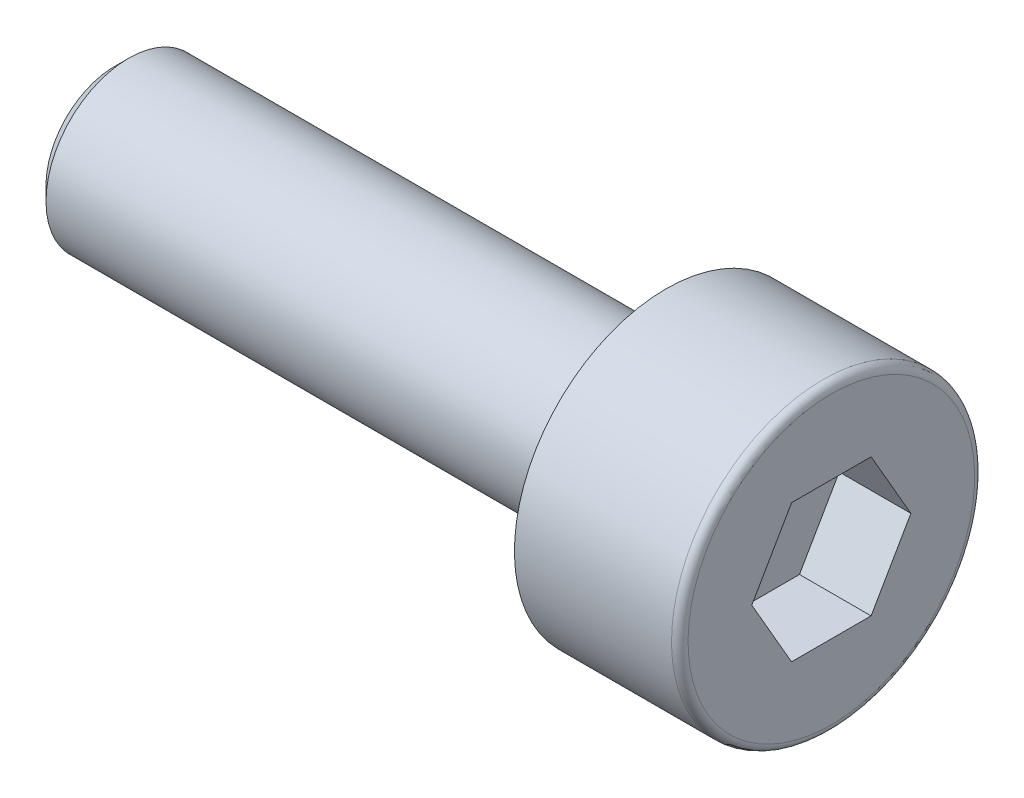
ISO-10303-21;
HEADER;
FILE_DESCRIPTION(('STEP AP214'),'2;1');
FILE_NAME('part.step','',(''),(''),'','','');
FILE_SCHEMA(('AUTOMOTIVE_DESIGN { 1 0 10303 214 1 1 1 1 }'));
ENDSEC;
DATA;
#1=APPLICATION_CONTEXT('core data for automotive mechanical design processes');
#2=APPLICATION_PROTOCOL_DEFINITION('international standard','automotive_design',2000,#1);
#3=PRODUCT_CONTEXT('',#1,'mechanical');
#4=PRODUCT('Part','Part','',(#3));
#5=PRODUCT_RELATED_PRODUCT_CATEGORY('part','',(#4));
#6=PRODUCT_DEFINITION_FORMATION('','',#4);
#7=PRODUCT_DEFINITION_CONTEXT('part definition',#1,'design');
#8=PRODUCT_DEFINITION('design','',#6,#7);
#9=PRODUCT_DEFINITION_SHAPE('','',#8);
#10=(LENGTH_UNIT() NAMED_UNIT(*) SI_UNIT(.MILLI.,.METRE.));
#11=(NAMED_UNIT(*) PLANE_ANGLE_UNIT() SI_UNIT($,.RADIAN.));
#12=(NAMED_UNIT(*) SI_UNIT($,.STERADIAN.) SOLID_ANGLE_UNIT());
#13=UNCERTAINTY_MEASURE_WITH_UNIT(LENGTH_MEASURE(1.E-05),#10,'distance_accuracy_value','');
#14=(GEOMETRIC_REPRESENTATION_CONTEXT(3) GLOBAL_UNCERTAINTY_ASSIGNED_CONTEXT((#13)) GLOBAL_UNIT_ASSIGNED_CONTEXT((#10,
#11,#12)) REPRESENTATION_CONTEXT('',''));
#15=CARTESIAN_POINT('',(0.,0.,0.));
#16=DIRECTION('',(0.,0.,1.));
#17=DIRECTION('',(1.,0.,0.));
#18=AXIS2_PLACEMENT_3D('',#15,#16,#17);
#19=CARTESIAN_POINT('',(0.,0.,0.));
#20=DIRECTION('',(1.,0.,0.));
#21=DIRECTION('',(0.,1.,0.));
#22=AXIS2_PLACEMENT_3D('',#19,#20,#21);
#23=PLANE('',#22);
#24=DIRECTION('',(0.,-0.866025403784439,0.5));
#25=VECTOR('',#24,1.);
#26=CARTESIAN_POINT('',(0.,1.25,0.721687836487035));
#27=LINE('',#26,#25);
#28=CARTESIAN_POINT('',(0.,1.25,0.721687836487035));
#29=VERTEX_POINT('',#28);
#30=CARTESIAN_POINT('',(0.,0.,1.44337567297407));
#31=VERTEX_POINT('',#30);
#32=EDGE_CURVE('E30',#29,#31,#27,.T.);
#33=ORIENTED_EDGE('',*,*,#32,.F.);
#34=DIRECTION('',(0.,0.,1.));
#35=VECTOR('',#34,1.);
#36=CARTESIAN_POINT('',(0.,1.25,-0.721687836487035));
#37=LINE('',#36,#35);
#38=CARTESIAN_POINT('',(0.,1.25,-0.721687836487035));
#39=VERTEX_POINT('',#38);
#40=EDGE_CURVE('E113',#39,#29,#37,.T.);
#41=ORIENTED_EDGE('',*,*,#40,.F.);
#42=DIRECTION('',(0.,0.866025403784439,0.5));
#43=VECTOR('',#42,1.);
#44=CARTESIAN_POINT('',(0.,0.,-1.44337567297406));
#45=LINE('',#44,#43);
#46=CARTESIAN_POINT('',(0.,0.,-1.44337567297406));
#47=VERTEX_POINT('',#46);
#48=EDGE_CURVE('E111',#47,#39,#45,.T.);
#49=ORIENTED_EDGE('',*,*,#48,.F.);
#50=DIRECTION('',(0.,0.866025403784439,-0.5));
#51=VECTOR('',#50,1.);
#52=CARTESIAN_POINT('',(0.,-1.25,-0.721687836487029));
#53=LINE('',#52,#51);
#54=CARTESIAN_POINT('',(0.,-1.25,-0.721687836487029));
#55=VERTEX_POINT('',#54);
#56=EDGE_CURVE('E78',#55,#47,#53,.T.);
#57=ORIENTED_EDGE('',*,*,#56,.F.);
#58=DIRECTION('',(0.,0.,-1.));
#59=VECTOR('',#58,1.);
#60=CARTESIAN_POINT('',(0.,-1.25,0.721687836487035));
#61=LINE('',#60,#59);
#62=CARTESIAN_POINT('',(0.,-1.25,0.721687836487035));
#63=VERTEX_POINT('',#62);
#64=EDGE_CURVE('E107',#63,#55,#61,.T.);
#65=ORIENTED_EDGE('',*,*,#64,.F.);
#66=DIRECTION('',(0.,-0.866025403784439,-0.5));
#67=VECTOR('',#66,1.);
#68=CARTESIAN_POINT('',(0.,0.,1.44337567297407));
#69=LINE('',#68,#67);
#70=EDGE_CURVE('E104',#31,#63,#69,.T.);
#71=ORIENTED_EDGE('',*,*,#70,.F.);
#72=EDGE_LOOP('',(#33,#41,#49,#57,#65,#71));
#73=FACE_BOUND('',#72,.T.);
#74=CARTESIAN_POINT('',(0.,0.,0.));
#75=DIRECTION('',(1.,0.,0.));
#76=DIRECTION('',(0.,1.,0.));
#77=AXIS2_PLACEMENT_3D('',#74,#75,#76);
#78=CIRCLE('',#77,2.6);
#79=CARTESIAN_POINT('',(0.,2.6,0.));
#80=VERTEX_POINT('',#79);
#81=EDGE_CURVE('E131',#80,#80,#78,.T.);
#82=ORIENTED_EDGE('',*,*,#81,.T.);
#83=EDGE_LOOP('',(#82));
#84=FACE_BOUND('',#83,.T.);
#85=ADVANCED_FACE('F15',(#73,#84),#23,.T.);
#86=CARTESIAN_POINT('',(-0.15,0.,0.));
#87=DIRECTION('',(1.,0.,0.));
#88=DIRECTION('',(0.,1.,0.));
#89=AXIS2_PLACEMENT_3D('',#86,#87,#88);
#90=TOROIDAL_SURFACE('',#89,2.6,0.15);
#91=CARTESIAN_POINT('',(-0.15,0.,0.));
#92=DIRECTION('',(1.,0.,0.));
#93=DIRECTION('',(0.,1.,0.));
#94=AXIS2_PLACEMENT_3D('',#91,#92,#93);
#95=CIRCLE('',#94,2.75);
#96=CARTESIAN_POINT('',(-0.15,2.75,0.));
#97=VERTEX_POINT('',#96);
#98=EDGE_CURVE('E128',#97,#97,#95,.T.);
#99=ORIENTED_EDGE('',*,*,#98,.T.);
#100=EDGE_LOOP('',(#99));
#101=FACE_BOUND('',#100,.T.);
#102=ORIENTED_EDGE('',*,*,#81,.F.);
#103=EDGE_LOOP('',(#102));
#104=FACE_BOUND('',#103,.T.);
#105=ADVANCED_FACE('F150',(#101,#104),#90,.T.);
#106=CARTESIAN_POINT('',(0.,0.,0.));
#107=DIRECTION('',(1.,0.,0.));
#108=DIRECTION('',(0.,1.,0.));
#109=AXIS2_PLACEMENT_3D('',#106,#107,#108);
#110=CYLINDRICAL_SURFACE('',#109,2.75);
#111=CARTESIAN_POINT('',(-3.,0.,0.));
#112=DIRECTION('',(1.,0.,0.));
#113=DIRECTION('',(0.,1.,0.));
#114=AXIS2_PLACEMENT_3D('',#111,#112,#113);
#115=CIRCLE('',#114,2.75);
#116=CARTESIAN_POINT('',(-3.,2.75,0.));
#117=VERTEX_POINT('',#116);
#118=EDGE_CURVE('E125',#117,#117,#115,.T.);
#119=ORIENTED_EDGE('',*,*,#118,.T.);
#120=EDGE_LOOP('',(#119));
#121=FACE_BOUND('',#120,.T.);
#122=ORIENTED_EDGE('',*,*,#98,.F.);
#123=EDGE_LOOP('',(#122));
#124=FACE_BOUND('',#123,.T.);
#125=ADVANCED_FACE('F156',(#121,#124),#110,.T.);
#126=CARTESIAN_POINT('',(-3.,2.75,0.));
#127=DIRECTION('',(-1.,0.,0.));
#128=DIRECTION('',(0.,-1.,0.));
#129=AXIS2_PLACEMENT_3D('',#126,#127,#128);
#130=PLANE('',#129);
#131=CARTESIAN_POINT('',(-3.,0.,0.));
#132=DIRECTION('',(1.,0.,0.));
#133=DIRECTION('',(0.,1.,0.));
#134=AXIS2_PLACEMENT_3D('',#131,#132,#133);
#135=CIRCLE('',#134,1.5);
#136=CARTESIAN_POINT('',(-3.,1.5,0.));
#137=VERTEX_POINT('',#136);
#138=EDGE_CURVE('E117',#137,#137,#135,.T.);
#139=ORIENTED_EDGE('',*,*,#138,.T.);
#140=EDGE_LOOP('',(#139));
#141=FACE_BOUND('',#140,.T.);
#142=ORIENTED_EDGE('',*,*,#118,.F.);
#143=EDGE_LOOP('',(#142));
#144=FACE_BOUND('',#143,.T.);
#145=ADVANCED_FACE('F163',(#141,#144),#130,.T.);
#146=CARTESIAN_POINT('',(0.,0.,0.));
#147=DIRECTION('',(1.,0.,0.));
#148=DIRECTION('',(0.,1.,0.));
#149=AXIS2_PLACEMENT_3D('',#146,#147,#148);
#150=CYLINDRICAL_SURFACE('',#149,1.5);
#151=CARTESIAN_POINT('',(-12.75,0.,0.));
#152=DIRECTION('',(-1.,0.,0.));
#153=DIRECTION('',(0.,-1.,0.));
#154=AXIS2_PLACEMENT_3D('',#151,#152,#153);
#155=CIRCLE('',#154,1.5);
#156=CARTESIAN_POINT('',(-12.75,-1.5,0.));
#157=VERTEX_POINT('',#156);
#158=EDGE_CURVE('E23',#157,#157,#155,.F.);
#159=ORIENTED_EDGE('',*,*,#158,.T.);
#160=EDGE_LOOP('',(#159));
#161=FACE_BOUND('',#160,.T.);
#162=ORIENTED_EDGE('',*,*,#138,.F.);
#163=EDGE_LOOP('',(#162));
#164=FACE_BOUND('',#163,.T.);
#165=ADVANCED_FACE('F136',(#161,#164),#150,.T.);
#166=CARTESIAN_POINT('',(-13.,1.5,0.));
#167=DIRECTION('',(-1.,0.,0.));
#168=DIRECTION('',(0.,-1.,0.));
#169=AXIS2_PLACEMENT_3D('',#166,#167,#168);
#170=PLANE('',#169);
#171=CARTESIAN_POINT('',(-13.,0.,0.));
#172=DIRECTION('',(-1.,0.,0.));
#173=DIRECTION('',(0.,-1.,0.));
#174=AXIS2_PLACEMENT_3D('',#171,#172,#173);
#175=CIRCLE('',#174,1.25);
#176=CARTESIAN_POINT('',(-13.,-1.25,0.));
#177=VERTEX_POINT('',#176);
#178=EDGE_CURVE('E9',#177,#177,#175,.T.);
#179=ORIENTED_EDGE('',*,*,#178,.T.);
#180=EDGE_LOOP('',(#179));
#181=FACE_BOUND('',#180,.T.);
#182=ADVANCED_FACE('F170',(#181),#170,.T.);
#183=CARTESIAN_POINT('',(-1.3,1.25,0.721687836487035));
#184=DIRECTION('',(0.,0.5,0.866025403784439));
#185=DIRECTION('',(0.,-0.866025403784439,0.5));
#186=AXIS2_PLACEMENT_3D('',#183,#184,#185);
#187=PLANE('',#186);
#188=ORIENTED_EDGE('',*,*,#32,.T.);
#189=DIRECTION('',(1.,0.,0.));
#190=VECTOR('',#189,1.);
#191=CARTESIAN_POINT('',(-1.3,0.,1.44337567297407));
#192=LINE('',#191,#190);
#193=CARTESIAN_POINT('',(-1.3,0.,1.44337567297407));
#194=VERTEX_POINT('',#193);
#195=EDGE_CURVE('E60',#194,#31,#192,.T.);
#196=ORIENTED_EDGE('',*,*,#195,.F.);
#197=DIRECTION('',(0.,-0.866025403784439,0.5));
#198=VECTOR('',#197,1.);
#199=CARTESIAN_POINT('',(-1.3,1.25,0.721687836487035));
#200=LINE('',#199,#198);
#201=CARTESIAN_POINT('',(-1.3,1.25,0.721687836487035));
#202=VERTEX_POINT('',#201);
#203=EDGE_CURVE('E115',#202,#194,#200,.T.);
#204=ORIENTED_EDGE('',*,*,#203,.F.);
#205=DIRECTION('',(1.,0.,0.));
#206=VECTOR('',#205,1.);
#207=CARTESIAN_POINT('',(-1.3,1.25,0.721687836487035));
#208=LINE('',#207,#206);
#209=EDGE_CURVE('E38',#202,#29,#208,.T.);
#210=ORIENTED_EDGE('',*,*,#209,.T.);
#211=EDGE_LOOP('',(#188,#196,#204,#210));
#212=FACE_BOUND('',#211,.T.);
#213=ADVANCED_FACE('F173',(#212),#187,.F.);
#214=CARTESIAN_POINT('',(-1.3,1.25,-0.721687836487035));
#215=DIRECTION('',(0.,1.,0.));
#216=DIRECTION('',(-1.,0.,0.));
#217=AXIS2_PLACEMENT_3D('',#214,#215,#216);
#218=PLANE('',#217);
#219=ORIENTED_EDGE('',*,*,#40,.T.);
#220=ORIENTED_EDGE('',*,*,#209,.F.);
#221=DIRECTION('',(0.,0.,1.));
#222=VECTOR('',#221,1.);
#223=CARTESIAN_POINT('',(-1.3,1.25,-0.721687836487035));
#224=LINE('',#223,#222);
#225=CARTESIAN_POINT('',(-1.3,1.25,-0.721687836487035));
#226=VERTEX_POINT('',#225);
#227=EDGE_CURVE('E90',#226,#202,#224,.T.);
#228=ORIENTED_EDGE('',*,*,#227,.F.);
#229=DIRECTION('',(1.,0.,0.));
#230=VECTOR('',#229,1.);
#231=CARTESIAN_POINT('',(-1.3,1.25,-0.721687836487035));
#232=LINE('',#231,#230);
#233=EDGE_CURVE('E82',#226,#39,#232,.T.);
#234=ORIENTED_EDGE('',*,*,#233,.T.);
#235=EDGE_LOOP('',(#219,#220,#228,#234));
#236=FACE_BOUND('',#235,.T.);
#237=ADVANCED_FACE('F177',(#236),#218,.F.);
#238=CARTESIAN_POINT('',(-1.3,0.,-1.44337567297406));
#239=DIRECTION('',(0.,0.5,-0.866025403784439));
#240=DIRECTION('',(0.,0.866025403784439,0.5));
#241=AXIS2_PLACEMENT_3D('',#238,#239,#240);
#242=PLANE('',#241);
#243=ORIENTED_EDGE('',*,*,#48,.T.);
#244=ORIENTED_EDGE('',*,*,#233,.F.);
#245=DIRECTION('',(0.,0.866025403784439,0.5));
#246=VECTOR('',#245,1.);
#247=CARTESIAN_POINT('',(-1.3,0.,-1.44337567297406));
#248=LINE('',#247,#246);
#249=CARTESIAN_POINT('',(-1.3,0.,-1.44337567297406));
#250=VERTEX_POINT('',#249);
#251=EDGE_CURVE('E86',#250,#226,#248,.T.);
#252=ORIENTED_EDGE('',*,*,#251,.F.);
#253=DIRECTION('',(1.,0.,0.));
#254=VECTOR('',#253,1.);
#255=CARTESIAN_POINT('',(-1.3,0.,-1.44337567297406));
#256=LINE('',#255,#254);
#257=EDGE_CURVE('E71',#250,#47,#256,.T.);
#258=ORIENTED_EDGE('',*,*,#257,.T.);
#259=EDGE_LOOP('',(#243,#244,#252,#258));
#260=FACE_BOUND('',#259,.T.);
#261=ADVANCED_FACE('F87',(#260),#242,.F.);
#262=CARTESIAN_POINT('',(-1.3,-1.25,-0.721687836487029));
#263=DIRECTION('',(0.,-0.5,-0.866025403784439));
#264=DIRECTION('',(0.,0.866025403784439,-0.5));
#265=AXIS2_PLACEMENT_3D('',#262,#263,#264);
#266=PLANE('',#265);
#267=ORIENTED_EDGE('',*,*,#56,.T.);
#268=ORIENTED_EDGE('',*,*,#257,.F.);
#269=DIRECTION('',(0.,0.866025403784439,-0.5));
#270=VECTOR('',#269,1.);
#271=CARTESIAN_POINT('',(-1.3,-1.25,-0.721687836487029));
#272=LINE('',#271,#270);
#273=CARTESIAN_POINT('',(-1.3,-1.25,-0.721687836487029));
#274=VERTEX_POINT('',#273);
#275=EDGE_CURVE('E75',#274,#250,#272,.T.);
#276=ORIENTED_EDGE('',*,*,#275,.F.);
#277=DIRECTION('',(1.,0.,0.));
#278=VECTOR('',#277,1.);
#279=CARTESIAN_POINT('',(-1.3,-1.25,-0.721687836487029));
#280=LINE('',#279,#278);
#281=EDGE_CURVE('E83',#274,#55,#280,.T.);
#282=ORIENTED_EDGE('',*,*,#281,.T.);
#283=EDGE_LOOP('',(#267,#268,#276,#282));
#284=FACE_BOUND('',#283,.T.);
#285=ADVANCED_FACE('F73',(#284),#266,.F.);
#286=CARTESIAN_POINT('',(-1.3,-1.25,0.721687836487035));
#287=DIRECTION('',(0.,-1.,0.));
#288=DIRECTION('',(0.,0.,-1.));
#289=AXIS2_PLACEMENT_3D('',#286,#287,#288);
#290=PLANE('',#289);
#291=ORIENTED_EDGE('',*,*,#64,.T.);
#292=ORIENTED_EDGE('',*,*,#281,.F.);
#293=DIRECTION('',(0.,0.,-1.));
#294=VECTOR('',#293,1.);
#295=CARTESIAN_POINT('',(-1.3,-1.25,0.721687836487035));
#296=LINE('',#295,#294);
#297=CARTESIAN_POINT('',(-1.3,-1.25,0.721687836487035));
#298=VERTEX_POINT('',#297);
#299=EDGE_CURVE('E96',#298,#274,#296,.T.);
#300=ORIENTED_EDGE('',*,*,#299,.F.);
#301=DIRECTION('',(1.,0.,0.));
#302=VECTOR('',#301,1.);
#303=CARTESIAN_POINT('',(-1.3,-1.25,0.721687836487035));
#304=LINE('',#303,#302);
#305=EDGE_CURVE('E120',#298,#63,#304,.T.);
#306=ORIENTED_EDGE('',*,*,#305,.T.);
#307=EDGE_LOOP('',(#291,#292,#300,#306));
#308=FACE_BOUND('',#307,.T.);
#309=ADVANCED_FACE('F180',(#308),#290,.F.);
#310=CARTESIAN_POINT('',(-1.3,0.,1.44337567297407));
#311=DIRECTION('',(0.,-0.5,0.866025403784439));
#312=DIRECTION('',(0.,-0.866025403784439,-0.5));
#313=AXIS2_PLACEMENT_3D('',#310,#311,#312);
#314=PLANE('',#313);
#315=ORIENTED_EDGE('',*,*,#70,.T.);
#316=ORIENTED_EDGE('',*,*,#305,.F.);
#317=DIRECTION('',(0.,-0.866025403784439,-0.5));
#318=VECTOR('',#317,1.);
#319=CARTESIAN_POINT('',(-1.3,0.,1.44337567297407));
#320=LINE('',#319,#318);
#321=EDGE_CURVE('E98',#194,#298,#320,.T.);
#322=ORIENTED_EDGE('',*,*,#321,.F.);
#323=ORIENTED_EDGE('',*,*,#195,.T.);
#324=EDGE_LOOP('',(#315,#316,#322,#323));
#325=FACE_BOUND('',#324,.T.);
#326=ADVANCED_FACE('F146',(#325),#314,.F.);
#327=CARTESIAN_POINT('',(-1.3,0.,1.44337567297407));
#328=DIRECTION('',(1.,0.,0.));
#329=DIRECTION('',(0.,1.,0.));
#330=AXIS2_PLACEMENT_3D('',#327,#328,#329);
#331=PLANE('',#330);
#332=ORIENTED_EDGE('',*,*,#203,.T.);
#333=ORIENTED_EDGE('',*,*,#321,.T.);
#334=ORIENTED_EDGE('',*,*,#299,.T.);
#335=ORIENTED_EDGE('',*,*,#275,.T.);
#336=ORIENTED_EDGE('',*,*,#251,.T.);
#337=ORIENTED_EDGE('',*,*,#227,.T.);
#338=EDGE_LOOP('',(#332,#333,#334,#335,#336,#337));
#339=FACE_BOUND('',#338,.T.);
#340=ADVANCED_FACE('F93',(#339),#331,.T.);
#341=CARTESIAN_POINT('',(-12.75,0.,0.));
#342=DIRECTION('',(1.,0.,0.));
#343=DIRECTION('',(0.,1.,0.));
#344=AXIS2_PLACEMENT_3D('',#341,#342,#343);
#345=CONICAL_SURFACE('',#344,1.5,0.785398163397449);
#346=ORIENTED_EDGE('',*,*,#178,.F.);
#347=EDGE_LOOP('',(#346));
#348=FACE_BOUND('',#347,.T.);
#349=ORIENTED_EDGE('',*,*,#158,.F.);
#350=EDGE_LOOP('',(#349));
#351=FACE_BOUND('',#350,.T.);
#352=ADVANCED_FACE('F17',(#348,#351),#345,.T.);
#353=CLOSED_SHELL('',(#85,#105,#125,#145,#165,#182,#213,#237,#261,#285,#309,#326,#340,#352));
#354=MANIFOLD_SOLID_BREP('B1',#353);
#355=ADVANCED_BREP_SHAPE_REPRESENTATION('',(#18,#354),#14);
#356=SHAPE_DEFINITION_REPRESENTATION(#9,#355);
ENDSEC;
END-ISO-10303-21;
